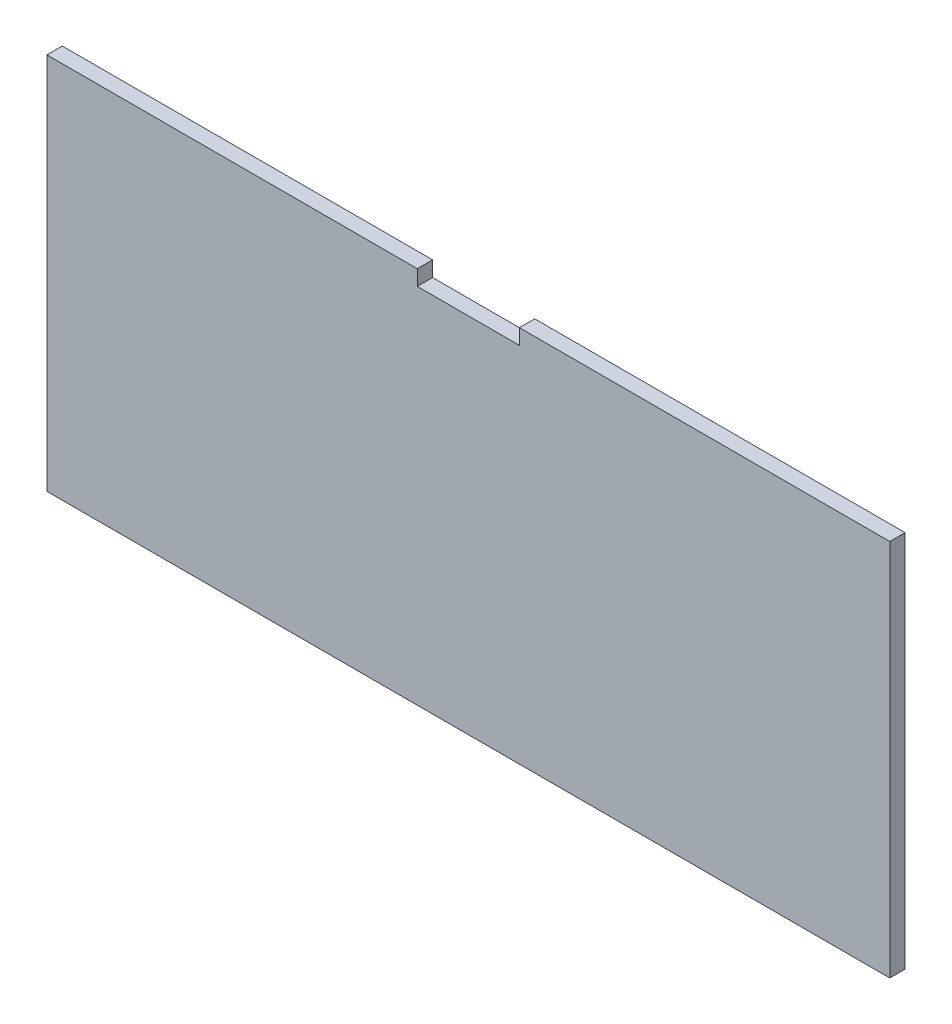
ISO-10303-21;
HEADER;
FILE_DESCRIPTION(('STEP AP214'),'2;1');
FILE_NAME('part.step','',(''),(''),'','','');
FILE_SCHEMA(('AUTOMOTIVE_DESIGN { 1 0 10303 214 1 1 1 1 }'));
ENDSEC;
DATA;
#1=APPLICATION_CONTEXT('core data for automotive mechanical design processes');
#2=APPLICATION_PROTOCOL_DEFINITION('international standard','automotive_design',2000,#1);
#3=PRODUCT_CONTEXT('',#1,'mechanical');
#4=PRODUCT('Part','Part','',(#3));
#5=PRODUCT_RELATED_PRODUCT_CATEGORY('part','',(#4));
#6=PRODUCT_DEFINITION_FORMATION('','',#4);
#7=PRODUCT_DEFINITION_CONTEXT('part definition',#1,'design');
#8=PRODUCT_DEFINITION('design','',#6,#7);
#9=PRODUCT_DEFINITION_SHAPE('','',#8);
#10=(LENGTH_UNIT() NAMED_UNIT(*) SI_UNIT(.MILLI.,.METRE.));
#11=(NAMED_UNIT(*) PLANE_ANGLE_UNIT() SI_UNIT($,.RADIAN.));
#12=(NAMED_UNIT(*) SI_UNIT($,.STERADIAN.) SOLID_ANGLE_UNIT());
#13=UNCERTAINTY_MEASURE_WITH_UNIT(LENGTH_MEASURE(1.E-05),#10,'distance_accuracy_value','');
#14=(GEOMETRIC_REPRESENTATION_CONTEXT(3) GLOBAL_UNCERTAINTY_ASSIGNED_CONTEXT((#13)) GLOBAL_UNIT_ASSIGNED_CONTEXT((#10,
#11,#12)) REPRESENTATION_CONTEXT('',''));
#15=CARTESIAN_POINT('',(0.,0.,0.));
#16=DIRECTION('',(0.,0.,1.));
#17=DIRECTION('',(1.,0.,0.));
#18=AXIS2_PLACEMENT_3D('',#15,#16,#17);
#19=CARTESIAN_POINT('',(0.,19.527086247824,-3.));
#20=DIRECTION('',(0.,-1.,0.));
#21=DIRECTION('',(0.,0.,-1.));
#22=AXIS2_PLACEMENT_3D('',#19,#20,#21);
#23=PLANE('',#22);
#24=DIRECTION('',(1.,0.,0.));
#25=VECTOR('',#24,1.);
#26=CARTESIAN_POINT('',(0.,19.527086247824,0.));
#27=LINE('',#26,#25);
#28=CARTESIAN_POINT('',(6.63873239436619,19.527086247824,0.));
#29=VERTEX_POINT('',#28);
#30=CARTESIAN_POINT('',(79.1387323943662,19.527086247824,0.));
#31=VERTEX_POINT('',#30);
#32=EDGE_CURVE('E146',#29,#31,#27,.T.);
#33=ORIENTED_EDGE('',*,*,#32,.T.);
#34=DIRECTION('',(0.,0.,1.));
#35=VECTOR('',#34,1.);
#36=CARTESIAN_POINT('',(79.1387323943662,19.527086247824,-3.));
#37=LINE('',#36,#35);
#38=CARTESIAN_POINT('',(79.1387323943662,19.527086247824,-3.));
#39=VERTEX_POINT('',#38);
#40=EDGE_CURVE('E11',#39,#31,#37,.T.);
#41=ORIENTED_EDGE('',*,*,#40,.F.);
#42=DIRECTION('',(1.,0.,0.));
#43=VECTOR('',#42,1.);
#44=CARTESIAN_POINT('',(0.,19.527086247824,-3.));
#45=LINE('',#44,#43);
#46=CARTESIAN_POINT('',(6.63873239436619,19.527086247824,-3.));
#47=VERTEX_POINT('',#46);
#48=EDGE_CURVE('E140',#47,#39,#45,.T.);
#49=ORIENTED_EDGE('',*,*,#48,.F.);
#50=DIRECTION('',(0.,0.,1.));
#51=VECTOR('',#50,1.);
#52=CARTESIAN_POINT('',(6.63873239436619,19.527086247824,-3.));
#53=LINE('',#52,#51);
#54=EDGE_CURVE('E45',#47,#29,#53,.T.);
#55=ORIENTED_EDGE('',*,*,#54,.T.);
#56=EDGE_LOOP('',(#33,#41,#49,#55));
#57=FACE_BOUND('',#56,.T.);
#58=ADVANCED_FACE('F41',(#57),#23,.F.);
#59=CARTESIAN_POINT('',(79.1387323943662,0.,-3.));
#60=DIRECTION('',(-1.,0.,0.));
#61=DIRECTION('',(0.,0.,1.));
#62=AXIS2_PLACEMENT_3D('',#59,#60,#61);
#63=PLANE('',#62);
#64=DIRECTION('',(0.,-1.,0.));
#65=VECTOR('',#64,1.);
#66=CARTESIAN_POINT('',(79.1387323943662,0.,0.));
#67=LINE('',#66,#65);
#68=CARTESIAN_POINT('',(79.1387323943662,-54.472913752176,0.));
#69=VERTEX_POINT('',#68);
#70=EDGE_CURVE('E94',#31,#69,#67,.T.);
#71=ORIENTED_EDGE('',*,*,#70,.T.);
#72=DIRECTION('',(0.,0.,1.));
#73=VECTOR('',#72,1.);
#74=CARTESIAN_POINT('',(79.1387323943662,-54.472913752176,-3.));
#75=LINE('',#74,#73);
#76=CARTESIAN_POINT('',(79.1387323943662,-54.472913752176,-3.));
#77=VERTEX_POINT('',#76);
#78=EDGE_CURVE('E52',#77,#69,#75,.T.);
#79=ORIENTED_EDGE('',*,*,#78,.F.);
#80=DIRECTION('',(0.,-1.,0.));
#81=VECTOR('',#80,1.);
#82=CARTESIAN_POINT('',(79.1387323943662,0.,-3.));
#83=LINE('',#82,#81);
#84=EDGE_CURVE('E60',#39,#77,#83,.T.);
#85=ORIENTED_EDGE('',*,*,#84,.F.);
#86=ORIENTED_EDGE('',*,*,#40,.T.);
#87=EDGE_LOOP('',(#71,#79,#85,#86));
#88=FACE_BOUND('',#87,.T.);
#89=ADVANCED_FACE('F199',(#88),#63,.F.);
#90=CARTESIAN_POINT('',(0.,-54.472913752176,-3.));
#91=DIRECTION('',(0.,-1.,0.));
#92=DIRECTION('',(0.,0.,-1.));
#93=AXIS2_PLACEMENT_3D('',#90,#91,#92);
#94=PLANE('',#93);
#95=DIRECTION('',(1.,0.,0.));
#96=VECTOR('',#95,1.);
#97=CARTESIAN_POINT('',(0.,-54.472913752176,0.));
#98=LINE('',#97,#96);
#99=CARTESIAN_POINT('',(-85.8612676056338,-54.472913752176,0.));
#100=VERTEX_POINT('',#99);
#101=EDGE_CURVE('E118',#100,#69,#98,.T.);
#102=ORIENTED_EDGE('',*,*,#101,.F.);
#103=DIRECTION('',(0.,0.,1.));
#104=VECTOR('',#103,1.);
#105=CARTESIAN_POINT('',(-85.8612676056338,-54.472913752176,-3.));
#106=LINE('',#105,#104);
#107=CARTESIAN_POINT('',(-85.8612676056338,-54.472913752176,-3.));
#108=VERTEX_POINT('',#107);
#109=EDGE_CURVE('E114',#108,#100,#106,.T.);
#110=ORIENTED_EDGE('',*,*,#109,.F.);
#111=DIRECTION('',(1.,0.,0.));
#112=VECTOR('',#111,1.);
#113=CARTESIAN_POINT('',(0.,-54.472913752176,-3.));
#114=LINE('',#113,#112);
#115=EDGE_CURVE('E117',#108,#77,#114,.T.);
#116=ORIENTED_EDGE('',*,*,#115,.T.);
#117=ORIENTED_EDGE('',*,*,#78,.T.);
#118=EDGE_LOOP('',(#102,#110,#116,#117));
#119=FACE_BOUND('',#118,.T.);
#120=ADVANCED_FACE('F116',(#119),#94,.T.);
#121=CARTESIAN_POINT('',(-85.8612676056338,0.,-3.));
#122=DIRECTION('',(-1.,0.,0.));
#123=DIRECTION('',(0.,-1.,0.));
#124=AXIS2_PLACEMENT_3D('',#121,#122,#123);
#125=PLANE('',#124);
#126=DIRECTION('',(0.,-1.,0.));
#127=VECTOR('',#126,1.);
#128=CARTESIAN_POINT('',(-85.8612676056338,0.,0.));
#129=LINE('',#128,#127);
#130=CARTESIAN_POINT('',(-85.8612676056338,19.527086247824,0.));
#131=VERTEX_POINT('',#130);
#132=EDGE_CURVE('E162',#131,#100,#129,.T.);
#133=ORIENTED_EDGE('',*,*,#132,.F.);
#134=DIRECTION('',(0.,0.,1.));
#135=VECTOR('',#134,1.);
#136=CARTESIAN_POINT('',(-85.8612676056338,19.527086247824,-3.));
#137=LINE('',#136,#135);
#138=CARTESIAN_POINT('',(-85.8612676056338,19.527086247824,-3.));
#139=VERTEX_POINT('',#138);
#140=EDGE_CURVE('E124',#139,#131,#137,.T.);
#141=ORIENTED_EDGE('',*,*,#140,.F.);
#142=DIRECTION('',(0.,-1.,0.));
#143=VECTOR('',#142,1.);
#144=CARTESIAN_POINT('',(-85.8612676056338,0.,-3.));
#145=LINE('',#144,#143);
#146=EDGE_CURVE('E129',#139,#108,#145,.T.);
#147=ORIENTED_EDGE('',*,*,#146,.T.);
#148=ORIENTED_EDGE('',*,*,#109,.T.);
#149=EDGE_LOOP('',(#133,#141,#147,#148));
#150=FACE_BOUND('',#149,.T.);
#151=ADVANCED_FACE('F132',(#150),#125,.T.);
#152=CARTESIAN_POINT('',(-13.3612676056338,19.527086247824,0.));
#153=VERTEX_POINT('',#152);
#154=EDGE_CURVE('E151',#131,#153,#27,.T.);
#155=ORIENTED_EDGE('',*,*,#154,.T.);
#156=DIRECTION('',(0.,0.,1.));
#157=VECTOR('',#156,1.);
#158=CARTESIAN_POINT('',(-13.3612676056338,19.527086247824,-3.));
#159=LINE('',#158,#157);
#160=CARTESIAN_POINT('',(-13.3612676056338,19.527086247824,-3.));
#161=VERTEX_POINT('',#160);
#162=EDGE_CURVE('E173',#161,#153,#159,.T.);
#163=ORIENTED_EDGE('',*,*,#162,.F.);
#164=EDGE_CURVE('E135',#139,#161,#45,.T.);
#165=ORIENTED_EDGE('',*,*,#164,.F.);
#166=ORIENTED_EDGE('',*,*,#140,.T.);
#167=EDGE_LOOP('',(#155,#163,#165,#166));
#168=FACE_BOUND('',#167,.T.);
#169=ADVANCED_FACE('F201',(#168),#23,.F.);
#170=CARTESIAN_POINT('',(-13.3612676056338,0.,-3.));
#171=DIRECTION('',(-1.,0.,0.));
#172=DIRECTION('',(0.,0.,1.));
#173=AXIS2_PLACEMENT_3D('',#170,#171,#172);
#174=PLANE('',#173);
#175=DIRECTION('',(0.,-1.,0.));
#176=VECTOR('',#175,1.);
#177=CARTESIAN_POINT('',(-13.3612676056338,0.,0.));
#178=LINE('',#177,#176);
#179=CARTESIAN_POINT('',(-13.3612676056338,16.527086247824,0.));
#180=VERTEX_POINT('',#179);
#181=EDGE_CURVE('E159',#153,#180,#178,.T.);
#182=ORIENTED_EDGE('',*,*,#181,.T.);
#183=DIRECTION('',(0.,0.,1.));
#184=VECTOR('',#183,1.);
#185=CARTESIAN_POINT('',(-13.3612676056338,16.527086247824,-3.));
#186=LINE('',#185,#184);
#187=CARTESIAN_POINT('',(-13.3612676056338,16.527086247824,-3.));
#188=VERTEX_POINT('',#187);
#189=EDGE_CURVE('E177',#188,#180,#186,.T.);
#190=ORIENTED_EDGE('',*,*,#189,.F.);
#191=DIRECTION('',(0.,-1.,0.));
#192=VECTOR('',#191,1.);
#193=CARTESIAN_POINT('',(-13.3612676056338,0.,-3.));
#194=LINE('',#193,#192);
#195=EDGE_CURVE('E138',#161,#188,#194,.T.);
#196=ORIENTED_EDGE('',*,*,#195,.F.);
#197=ORIENTED_EDGE('',*,*,#162,.T.);
#198=EDGE_LOOP('',(#182,#190,#196,#197));
#199=FACE_BOUND('',#198,.T.);
#200=ADVANCED_FACE('F196',(#199),#174,.F.);
#201=CARTESIAN_POINT('',(0.,16.527086247824,-3.));
#202=DIRECTION('',(0.,-1.,0.));
#203=DIRECTION('',(0.,0.,-1.));
#204=AXIS2_PLACEMENT_3D('',#201,#202,#203);
#205=PLANE('',#204);
#206=DIRECTION('',(1.,0.,0.));
#207=VECTOR('',#206,1.);
#208=CARTESIAN_POINT('',(0.,16.527086247824,0.));
#209=LINE('',#208,#207);
#210=CARTESIAN_POINT('',(6.63873239436619,16.527086247824,0.));
#211=VERTEX_POINT('',#210);
#212=EDGE_CURVE('E155',#180,#211,#209,.T.);
#213=ORIENTED_EDGE('',*,*,#212,.T.);
#214=DIRECTION('',(0.,0.,1.));
#215=VECTOR('',#214,1.);
#216=CARTESIAN_POINT('',(6.63873239436619,16.527086247824,-3.));
#217=LINE('',#216,#215);
#218=CARTESIAN_POINT('',(6.63873239436619,16.527086247824,-3.));
#219=VERTEX_POINT('',#218);
#220=EDGE_CURVE('E180',#219,#211,#217,.T.);
#221=ORIENTED_EDGE('',*,*,#220,.F.);
#222=DIRECTION('',(1.,0.,0.));
#223=VECTOR('',#222,1.);
#224=CARTESIAN_POINT('',(0.,16.527086247824,-3.));
#225=LINE('',#224,#223);
#226=EDGE_CURVE('E222',#188,#219,#225,.T.);
#227=ORIENTED_EDGE('',*,*,#226,.F.);
#228=ORIENTED_EDGE('',*,*,#189,.T.);
#229=EDGE_LOOP('',(#213,#221,#227,#228));
#230=FACE_BOUND('',#229,.T.);
#231=ADVANCED_FACE('F190',(#230),#205,.F.);
#232=CARTESIAN_POINT('',(6.63873239436619,0.,-3.));
#233=DIRECTION('',(-1.,0.,0.));
#234=DIRECTION('',(0.,0.,1.));
#235=AXIS2_PLACEMENT_3D('',#232,#233,#234);
#236=PLANE('',#235);
#237=DIRECTION('',(0.,-1.,0.));
#238=VECTOR('',#237,1.);
#239=CARTESIAN_POINT('',(6.63873239436619,0.,0.));
#240=LINE('',#239,#238);
#241=EDGE_CURVE('E150',#29,#211,#240,.T.);
#242=ORIENTED_EDGE('',*,*,#241,.F.);
#243=ORIENTED_EDGE('',*,*,#54,.F.);
#244=DIRECTION('',(0.,-1.,0.));
#245=VECTOR('',#244,1.);
#246=CARTESIAN_POINT('',(6.63873239436619,0.,-3.));
#247=LINE('',#246,#245);
#248=EDGE_CURVE('E224',#47,#219,#247,.T.);
#249=ORIENTED_EDGE('',*,*,#248,.T.);
#250=ORIENTED_EDGE('',*,*,#220,.T.);
#251=EDGE_LOOP('',(#242,#243,#249,#250));
#252=FACE_BOUND('',#251,.T.);
#253=ADVANCED_FACE('F43',(#252),#236,.T.);
#254=CARTESIAN_POINT('',(0.,0.,-3.));
#255=DIRECTION('',(0.,0.,1.));
#256=DIRECTION('',(1.,0.,0.));
#257=AXIS2_PLACEMENT_3D('',#254,#255,#256);
#258=PLANE('',#257);
#259=ORIENTED_EDGE('',*,*,#48,.T.);
#260=ORIENTED_EDGE('',*,*,#84,.T.);
#261=ORIENTED_EDGE('',*,*,#115,.F.);
#262=ORIENTED_EDGE('',*,*,#146,.F.);
#263=ORIENTED_EDGE('',*,*,#164,.T.);
#264=ORIENTED_EDGE('',*,*,#195,.T.);
#265=ORIENTED_EDGE('',*,*,#226,.T.);
#266=ORIENTED_EDGE('',*,*,#248,.F.);
#267=EDGE_LOOP('',(#259,#260,#261,#262,#263,#264,#265,#266));
#268=FACE_BOUND('',#267,.T.);
#269=ADVANCED_FACE('F128',(#268),#258,.F.);
#270=CARTESIAN_POINT('',(0.,0.,0.));
#271=DIRECTION('',(0.,0.,1.));
#272=DIRECTION('',(1.,0.,0.));
#273=AXIS2_PLACEMENT_3D('',#270,#271,#272);
#274=PLANE('',#273);
#275=ORIENTED_EDGE('',*,*,#32,.F.);
#276=ORIENTED_EDGE('',*,*,#241,.T.);
#277=ORIENTED_EDGE('',*,*,#212,.F.);
#278=ORIENTED_EDGE('',*,*,#181,.F.);
#279=ORIENTED_EDGE('',*,*,#154,.F.);
#280=ORIENTED_EDGE('',*,*,#132,.T.);
#281=ORIENTED_EDGE('',*,*,#101,.T.);
#282=ORIENTED_EDGE('',*,*,#70,.F.);
#283=EDGE_LOOP('',(#275,#276,#277,#278,#279,#280,#281,#282));
#284=FACE_BOUND('',#283,.T.);
#285=ADVANCED_FACE('F187',(#284),#274,.T.);
#286=CLOSED_SHELL('',(#58,#89,#120,#151,#169,#200,#231,#253,#269,#285));
#287=MANIFOLD_SOLID_BREP('B2',#286);
#288=ADVANCED_BREP_SHAPE_REPRESENTATION('',(#18,#287),#14);
#289=SHAPE_DEFINITION_REPRESENTATION(#9,#288);
ENDSEC;
END-ISO-10303-21;
